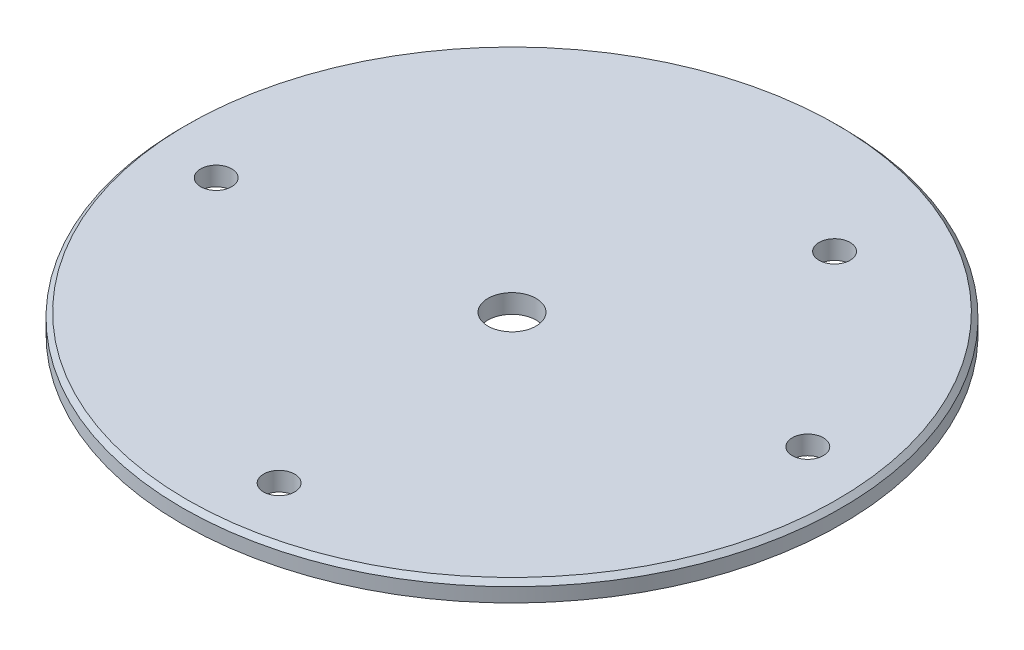
ISO-10303-21;
HEADER;
FILE_DESCRIPTION(('STEP AP214'),'2;1');
FILE_NAME('part.step','',(''),(''),'','','');
FILE_SCHEMA(('AUTOMOTIVE_DESIGN { 1 0 10303 214 1 1 1 1 }'));
ENDSEC;
DATA;
#1=APPLICATION_CONTEXT('core data for automotive mechanical design processes');
#2=APPLICATION_PROTOCOL_DEFINITION('international standard','automotive_design',2000,#1);
#3=PRODUCT_CONTEXT('',#1,'mechanical');
#4=PRODUCT('Part','Part','',(#3));
#5=PRODUCT_RELATED_PRODUCT_CATEGORY('part','',(#4));
#6=PRODUCT_DEFINITION_FORMATION('','',#4);
#7=PRODUCT_DEFINITION_CONTEXT('part definition',#1,'design');
#8=PRODUCT_DEFINITION('design','',#6,#7);
#9=PRODUCT_DEFINITION_SHAPE('','',#8);
#10=(LENGTH_UNIT() NAMED_UNIT(*) SI_UNIT(.MILLI.,.METRE.));
#11=(NAMED_UNIT(*) PLANE_ANGLE_UNIT() SI_UNIT($,.RADIAN.));
#12=(NAMED_UNIT(*) SI_UNIT($,.STERADIAN.) SOLID_ANGLE_UNIT());
#13=UNCERTAINTY_MEASURE_WITH_UNIT(LENGTH_MEASURE(1.E-05),#10,'distance_accuracy_value','');
#14=(GEOMETRIC_REPRESENTATION_CONTEXT(3) GLOBAL_UNCERTAINTY_ASSIGNED_CONTEXT((#13)) GLOBAL_UNIT_ASSIGNED_CONTEXT((#10,
#11,#12)) REPRESENTATION_CONTEXT('',''));
#15=CARTESIAN_POINT('',(0.,0.,0.));
#16=DIRECTION('',(0.,0.,1.));
#17=DIRECTION('',(1.,0.,0.));
#18=AXIS2_PLACEMENT_3D('',#15,#16,#17);
#19=CARTESIAN_POINT('',(0.,2.,0.));
#20=DIRECTION('',(0.,1.,0.));
#21=DIRECTION('',(0.,0.,1.));
#22=AXIS2_PLACEMENT_3D('',#19,#20,#21);
#23=PLANE('',#22);
#24=CARTESIAN_POINT('',(3.34261125462233,2.,28.0860632698943));
#25=DIRECTION('',(0.,1.,0.));
#26=DIRECTION('',(0.,0.,1.));
#27=AXIS2_PLACEMENT_3D('',#24,#25,#26);
#28=CIRCLE('',#27,1.64999999999999);
#29=CARTESIAN_POINT('',(3.34261125462233,2.,29.7360632698943));
#30=VERTEX_POINT('',#29);
#31=EDGE_CURVE('E96',#30,#30,#28,.T.);
#32=ORIENTED_EDGE('',*,*,#31,.F.);
#33=EDGE_LOOP('',(#32));
#34=FACE_BOUND('',#33,.T.);
#35=CARTESIAN_POINT('',(-28.0860632698935,2.,3.34261125462274));
#36=DIRECTION('',(0.,1.,0.));
#37=DIRECTION('',(0.,0.,1.));
#38=AXIS2_PLACEMENT_3D('',#35,#36,#37);
#39=CIRCLE('',#38,1.64999999999998);
#40=CARTESIAN_POINT('',(-28.0860632698935,2.,4.99261125462272));
#41=VERTEX_POINT('',#40);
#42=EDGE_CURVE('E88',#41,#41,#39,.T.);
#43=ORIENTED_EDGE('',*,*,#42,.F.);
#44=EDGE_LOOP('',(#43));
#45=FACE_BOUND('',#44,.T.);
#46=CARTESIAN_POINT('',(11.5360731939805,2.,-22.7358530797308));
#47=DIRECTION('',(0.,1.,0.));
#48=DIRECTION('',(0.,0.,1.));
#49=AXIS2_PLACEMENT_3D('',#46,#47,#48);
#50=CIRCLE('',#49,1.64999999999999);
#51=CARTESIAN_POINT('',(11.5360731939805,2.,-21.0858530797308));
#52=VERTEX_POINT('',#51);
#53=EDGE_CURVE('E80',#52,#52,#50,.T.);
#54=ORIENTED_EDGE('',*,*,#53,.F.);
#55=EDGE_LOOP('',(#54));
#56=FACE_BOUND('',#55,.T.);
#57=CARTESIAN_POINT('',(28.0860632698939,2.,-3.34261125462154));
#58=DIRECTION('',(0.,1.,0.));
#59=DIRECTION('',(0.,0.,1.));
#60=AXIS2_PLACEMENT_3D('',#57,#58,#59);
#61=CIRCLE('',#60,1.64999999999998);
#62=CARTESIAN_POINT('',(28.0860632698939,2.,-1.69261125462156));
#63=VERTEX_POINT('',#62);
#64=EDGE_CURVE('E72',#63,#63,#61,.T.);
#65=ORIENTED_EDGE('',*,*,#64,.F.);
#66=EDGE_LOOP('',(#65));
#67=FACE_BOUND('',#66,.T.);
#68=CARTESIAN_POINT('',(0.,2.,0.));
#69=DIRECTION('',(0.,1.,0.));
#70=DIRECTION('',(0.,0.,1.));
#71=AXIS2_PLACEMENT_3D('',#68,#69,#70);
#72=CIRCLE('',#71,34.515);
#73=CARTESIAN_POINT('',(0.,2.,34.515));
#74=VERTEX_POINT('',#73);
#75=EDGE_CURVE('E48',#74,#74,#72,.T.);
#76=ORIENTED_EDGE('',*,*,#75,.T.);
#77=EDGE_LOOP('',(#76));
#78=FACE_BOUND('',#77,.T.);
#79=CARTESIAN_POINT('',(0.,2.,0.));
#80=DIRECTION('',(0.,1.,0.));
#81=DIRECTION('',(0.,0.,1.));
#82=AXIS2_PLACEMENT_3D('',#79,#80,#81);
#83=CIRCLE('',#82,2.555);
#84=CARTESIAN_POINT('',(0.,2.,2.555));
#85=VERTEX_POINT('',#84);
#86=EDGE_CURVE('E58',#85,#85,#83,.T.);
#87=ORIENTED_EDGE('',*,*,#86,.F.);
#88=EDGE_LOOP('',(#87));
#89=FACE_BOUND('',#88,.T.);
#90=ADVANCED_FACE('F40',(#34,#45,#56,#67,#78,#89),#23,.T.);
#91=CARTESIAN_POINT('',(0.,0.,0.));
#92=DIRECTION('',(0.,1.,0.));
#93=DIRECTION('',(0.,0.,1.));
#94=AXIS2_PLACEMENT_3D('',#91,#92,#93);
#95=PLANE('',#94);
#96=CARTESIAN_POINT('',(3.34261125462233,0.,28.0860632698943));
#97=DIRECTION('',(0.,1.,0.));
#98=DIRECTION('',(0.,0.,1.));
#99=AXIS2_PLACEMENT_3D('',#96,#97,#98);
#100=CIRCLE('',#99,1.64999999999999);
#101=CARTESIAN_POINT('',(3.34261125462233,0.,29.7360632698943));
#102=VERTEX_POINT('',#101);
#103=EDGE_CURVE('E92',#102,#102,#100,.T.);
#104=ORIENTED_EDGE('',*,*,#103,.T.);
#105=EDGE_LOOP('',(#104));
#106=FACE_BOUND('',#105,.T.);
#107=CARTESIAN_POINT('',(-28.0860632698935,0.,3.34261125462274));
#108=DIRECTION('',(0.,1.,0.));
#109=DIRECTION('',(0.,0.,1.));
#110=AXIS2_PLACEMENT_3D('',#107,#108,#109);
#111=CIRCLE('',#110,1.64999999999998);
#112=CARTESIAN_POINT('',(-28.0860632698935,0.,4.99261125462272));
#113=VERTEX_POINT('',#112);
#114=EDGE_CURVE('E84',#113,#113,#111,.T.);
#115=ORIENTED_EDGE('',*,*,#114,.T.);
#116=EDGE_LOOP('',(#115));
#117=FACE_BOUND('',#116,.T.);
#118=CARTESIAN_POINT('',(11.5360731939805,0.,-22.7358530797308));
#119=DIRECTION('',(0.,1.,0.));
#120=DIRECTION('',(0.,0.,1.));
#121=AXIS2_PLACEMENT_3D('',#118,#119,#120);
#122=CIRCLE('',#121,1.64999999999999);
#123=CARTESIAN_POINT('',(11.5360731939805,0.,-21.0858530797308));
#124=VERTEX_POINT('',#123);
#125=EDGE_CURVE('E76',#124,#124,#122,.T.);
#126=ORIENTED_EDGE('',*,*,#125,.T.);
#127=EDGE_LOOP('',(#126));
#128=FACE_BOUND('',#127,.T.);
#129=CARTESIAN_POINT('',(28.0860632698939,0.,-3.34261125462154));
#130=DIRECTION('',(0.,1.,0.));
#131=DIRECTION('',(0.,0.,1.));
#132=AXIS2_PLACEMENT_3D('',#129,#130,#131);
#133=CIRCLE('',#132,1.64999999999998);
#134=CARTESIAN_POINT('',(28.0860632698939,0.,-1.69261125462156));
#135=VERTEX_POINT('',#134);
#136=EDGE_CURVE('E65',#135,#135,#133,.T.);
#137=ORIENTED_EDGE('',*,*,#136,.T.);
#138=EDGE_LOOP('',(#137));
#139=FACE_BOUND('',#138,.T.);
#140=CARTESIAN_POINT('',(0.,0.,0.));
#141=DIRECTION('',(0.,1.,0.));
#142=DIRECTION('',(0.,0.,1.));
#143=AXIS2_PLACEMENT_3D('',#140,#141,#142);
#144=CIRCLE('',#143,35.015);
#145=CARTESIAN_POINT('',(0.,0.,35.015));
#146=VERTEX_POINT('',#145);
#147=EDGE_CURVE('E53',#146,#146,#144,.T.);
#148=ORIENTED_EDGE('',*,*,#147,.F.);
#149=EDGE_LOOP('',(#148));
#150=FACE_BOUND('',#149,.T.);
#151=CARTESIAN_POINT('',(0.,0.,0.));
#152=DIRECTION('',(0.,1.,0.));
#153=DIRECTION('',(0.,0.,1.));
#154=AXIS2_PLACEMENT_3D('',#151,#152,#153);
#155=CIRCLE('',#154,2.555);
#156=CARTESIAN_POINT('',(0.,0.,2.555));
#157=VERTEX_POINT('',#156);
#158=EDGE_CURVE('E61',#157,#157,#155,.T.);
#159=ORIENTED_EDGE('',*,*,#158,.T.);
#160=EDGE_LOOP('',(#159));
#161=FACE_BOUND('',#160,.T.);
#162=ADVANCED_FACE('F105',(#106,#117,#128,#139,#150,#161),#95,.F.);
#163=CARTESIAN_POINT('',(0.,2.,0.));
#164=DIRECTION('',(0.,-1.,0.));
#165=DIRECTION('',(0.,0.,-1.));
#166=AXIS2_PLACEMENT_3D('',#163,#164,#165);
#167=CYLINDRICAL_SURFACE('',#166,35.015);
#168=CARTESIAN_POINT('',(0.,1.50000000000001,0.));
#169=DIRECTION('',(0.,1.,0.));
#170=DIRECTION('',(0.,0.,1.));
#171=AXIS2_PLACEMENT_3D('',#168,#169,#170);
#172=CIRCLE('',#171,35.015);
#173=CARTESIAN_POINT('',(0.,1.50000000000001,35.015));
#174=VERTEX_POINT('',#173);
#175=EDGE_CURVE('E10',#174,#174,#172,.F.);
#176=ORIENTED_EDGE('',*,*,#175,.T.);
#177=EDGE_LOOP('',(#176));
#178=FACE_BOUND('',#177,.T.);
#179=ORIENTED_EDGE('',*,*,#147,.T.);
#180=EDGE_LOOP('',(#179));
#181=FACE_BOUND('',#180,.T.);
#182=ADVANCED_FACE('F118',(#178,#181),#167,.T.);
#183=CARTESIAN_POINT('',(0.,2.,0.));
#184=DIRECTION('',(0.,-1.,0.));
#185=DIRECTION('',(0.,0.,-1.));
#186=AXIS2_PLACEMENT_3D('',#183,#184,#185);
#187=CYLINDRICAL_SURFACE('',#186,2.555);
#188=ORIENTED_EDGE('',*,*,#86,.T.);
#189=EDGE_LOOP('',(#188));
#190=FACE_BOUND('',#189,.T.);
#191=ORIENTED_EDGE('',*,*,#158,.F.);
#192=EDGE_LOOP('',(#191));
#193=FACE_BOUND('',#192,.T.);
#194=ADVANCED_FACE('F115',(#190,#193),#187,.F.);
#195=CARTESIAN_POINT('',(0.,2.,0.));
#196=DIRECTION('',(0.,-1.,0.));
#197=DIRECTION('',(0.,0.,-1.));
#198=AXIS2_PLACEMENT_3D('',#195,#196,#197);
#199=CONICAL_SURFACE('',#198,34.515,0.785398163397441);
#200=ORIENTED_EDGE('',*,*,#175,.F.);
#201=EDGE_LOOP('',(#200));
#202=FACE_BOUND('',#201,.T.);
#203=ORIENTED_EDGE('',*,*,#75,.F.);
#204=EDGE_LOOP('',(#203));
#205=FACE_BOUND('',#204,.T.);
#206=ADVANCED_FACE('F42',(#202,#205),#199,.T.);
#207=CARTESIAN_POINT('',(28.0860632698939,2.,-3.34261125462154));
#208=DIRECTION('',(0.,1.,0.));
#209=DIRECTION('',(0.,0.,1.));
#210=AXIS2_PLACEMENT_3D('',#207,#208,#209);
#211=CYLINDRICAL_SURFACE('',#210,1.64999999999998);
#212=ORIENTED_EDGE('',*,*,#136,.F.);
#213=EDGE_LOOP('',(#212));
#214=FACE_BOUND('',#213,.T.);
#215=ORIENTED_EDGE('',*,*,#64,.T.);
#216=EDGE_LOOP('',(#215));
#217=FACE_BOUND('',#216,.T.);
#218=ADVANCED_FACE('F132',(#214,#217),#211,.F.);
#219=CARTESIAN_POINT('',(11.5360731939805,2.,-22.7358530797308));
#220=DIRECTION('',(0.,1.,0.));
#221=DIRECTION('',(0.,0.,1.));
#222=AXIS2_PLACEMENT_3D('',#219,#220,#221);
#223=CYLINDRICAL_SURFACE('',#222,1.64999999999999);
#224=ORIENTED_EDGE('',*,*,#125,.F.);
#225=EDGE_LOOP('',(#224));
#226=FACE_BOUND('',#225,.T.);
#227=ORIENTED_EDGE('',*,*,#53,.T.);
#228=EDGE_LOOP('',(#227));
#229=FACE_BOUND('',#228,.T.);
#230=ADVANCED_FACE('F135',(#226,#229),#223,.F.);
#231=CARTESIAN_POINT('',(-28.0860632698935,2.,3.34261125462274));
#232=DIRECTION('',(0.,1.,0.));
#233=DIRECTION('',(0.,0.,1.));
#234=AXIS2_PLACEMENT_3D('',#231,#232,#233);
#235=CYLINDRICAL_SURFACE('',#234,1.64999999999998);
#236=ORIENTED_EDGE('',*,*,#114,.F.);
#237=EDGE_LOOP('',(#236));
#238=FACE_BOUND('',#237,.T.);
#239=ORIENTED_EDGE('',*,*,#42,.T.);
#240=EDGE_LOOP('',(#239));
#241=FACE_BOUND('',#240,.T.);
#242=ADVANCED_FACE('F139',(#238,#241),#235,.F.);
#243=CARTESIAN_POINT('',(3.34261125462233,2.,28.0860632698943));
#244=DIRECTION('',(0.,1.,0.));
#245=DIRECTION('',(0.,0.,1.));
#246=AXIS2_PLACEMENT_3D('',#243,#244,#245);
#247=CYLINDRICAL_SURFACE('',#246,1.64999999999999);
#248=ORIENTED_EDGE('',*,*,#103,.F.);
#249=EDGE_LOOP('',(#248));
#250=FACE_BOUND('',#249,.T.);
#251=ORIENTED_EDGE('',*,*,#31,.T.);
#252=EDGE_LOOP('',(#251));
#253=FACE_BOUND('',#252,.T.);
#254=ADVANCED_FACE('F101',(#250,#253),#247,.F.);
#255=CLOSED_SHELL('',(#90,#162,#182,#194,#206,#218,#230,#242,#254));
#256=MANIFOLD_SOLID_BREP('B2',#255);
#257=ADVANCED_BREP_SHAPE_REPRESENTATION('',(#18,#256),#14);
#258=SHAPE_DEFINITION_REPRESENTATION(#9,#257);
ENDSEC;
END-ISO-10303-21;
